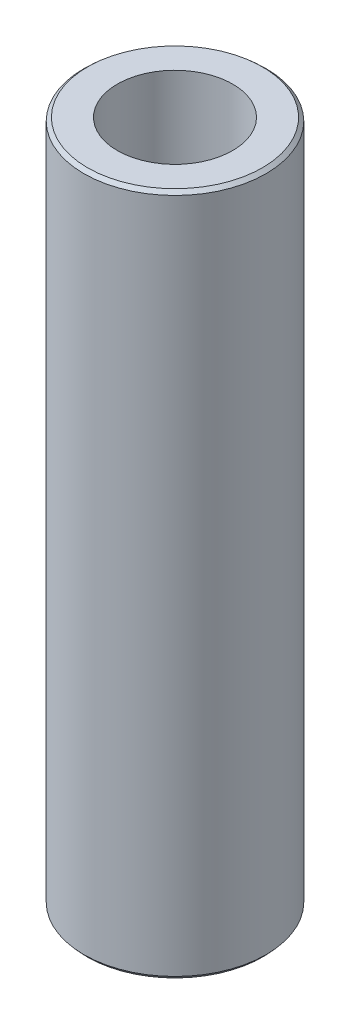
ISO-10303-21;
HEADER;
FILE_DESCRIPTION(('STEP AP214'),'2;1');
FILE_NAME('part.step','',(''),(''),'','','');
FILE_SCHEMA(('AUTOMOTIVE_DESIGN { 1 0 10303 214 1 1 1 1 }'));
ENDSEC;
DATA;
#1=APPLICATION_CONTEXT('core data for automotive mechanical design processes');
#2=APPLICATION_PROTOCOL_DEFINITION('international standard','automotive_design',2000,#1);
#3=PRODUCT_CONTEXT('',#1,'mechanical');
#4=PRODUCT('Part','Part','',(#3));
#5=PRODUCT_RELATED_PRODUCT_CATEGORY('part','',(#4));
#6=PRODUCT_DEFINITION_FORMATION('','',#4);
#7=PRODUCT_DEFINITION_CONTEXT('part definition',#1,'design');
#8=PRODUCT_DEFINITION('design','',#6,#7);
#9=PRODUCT_DEFINITION_SHAPE('','',#8);
#10=(LENGTH_UNIT() NAMED_UNIT(*) SI_UNIT(.MILLI.,.METRE.));
#11=(NAMED_UNIT(*) PLANE_ANGLE_UNIT() SI_UNIT($,.RADIAN.));
#12=(NAMED_UNIT(*) SI_UNIT($,.STERADIAN.) SOLID_ANGLE_UNIT());
#13=UNCERTAINTY_MEASURE_WITH_UNIT(LENGTH_MEASURE(1.E-05),#10,'distance_accuracy_value','');
#14=(GEOMETRIC_REPRESENTATION_CONTEXT(3) GLOBAL_UNCERTAINTY_ASSIGNED_CONTEXT((#13)) GLOBAL_UNIT_ASSIGNED_CONTEXT((#10,
#11,#12)) REPRESENTATION_CONTEXT('',''));
#15=CARTESIAN_POINT('',(0.,0.,0.));
#16=DIRECTION('',(0.,0.,1.));
#17=DIRECTION('',(1.,0.,0.));
#18=AXIS2_PLACEMENT_3D('',#15,#16,#17);
#19=CARTESIAN_POINT('',(0.,262.587591258309,0.));
#20=DIRECTION('',(0.,-1.,0.));
#21=DIRECTION('',(0.,0.,-1.));
#22=AXIS2_PLACEMENT_3D('',#19,#20,#21);
#23=CYLINDRICAL_SURFACE('',#22,35.);
#24=CARTESIAN_POINT('',(0.,261.322167376521,0.));
#25=DIRECTION('',(0.,1.,0.));
#26=DIRECTION('',(0.,0.,1.));
#27=AXIS2_PLACEMENT_3D('',#24,#25,#26);
#28=CIRCLE('',#27,35.);
#29=CARTESIAN_POINT('',(0.,261.322167376521,35.));
#30=VERTEX_POINT('',#29);
#31=EDGE_CURVE('E50',#30,#30,#28,.F.);
#32=ORIENTED_EDGE('',*,*,#31,.T.);
#33=EDGE_LOOP('',(#32));
#34=FACE_BOUND('',#33,.T.);
#35=CARTESIAN_POINT('',(0.,1.40365622843841,0.));
#36=DIRECTION('',(0.,1.,0.));
#37=DIRECTION('',(0.,0.,1.));
#38=AXIS2_PLACEMENT_3D('',#35,#36,#37);
#39=CIRCLE('',#38,35.);
#40=CARTESIAN_POINT('',(0.,1.40365622843841,35.));
#41=VERTEX_POINT('',#40);
#42=EDGE_CURVE('E51',#41,#41,#39,.T.);
#43=ORIENTED_EDGE('',*,*,#42,.T.);
#44=EDGE_LOOP('',(#43));
#45=FACE_BOUND('',#44,.T.);
#46=ADVANCED_FACE('F39',(#34,#45),#23,.T.);
#47=CARTESIAN_POINT('',(0.,262.587591258309,0.));
#48=DIRECTION('',(0.,1.,0.));
#49=DIRECTION('',(0.,0.,1.));
#50=AXIS2_PLACEMENT_3D('',#47,#48,#49);
#51=PLANE('',#50);
#52=CARTESIAN_POINT('',(0.,262.587591258309,0.));
#53=DIRECTION('',(0.,1.,0.));
#54=DIRECTION('',(0.,0.,1.));
#55=AXIS2_PLACEMENT_3D('',#52,#53,#54);
#56=CIRCLE('',#55,33.5963437715615);
#57=CARTESIAN_POINT('',(0.,262.587591258309,33.5963437715615));
#58=VERTEX_POINT('',#57);
#59=EDGE_CURVE('E54',#58,#58,#56,.T.);
#60=ORIENTED_EDGE('',*,*,#59,.T.);
#61=EDGE_LOOP('',(#60));
#62=FACE_BOUND('',#61,.T.);
#63=CARTESIAN_POINT('',(0.,262.587591258309,0.));
#64=DIRECTION('',(0.,1.,0.));
#65=DIRECTION('',(0.,0.,1.));
#66=AXIS2_PLACEMENT_3D('',#63,#64,#65);
#67=CIRCLE('',#66,22.1570664562936);
#68=CARTESIAN_POINT('',(0.,262.587591258309,22.1570664562936));
#69=VERTEX_POINT('',#68);
#70=EDGE_CURVE('E58',#69,#69,#67,.T.);
#71=ORIENTED_EDGE('',*,*,#70,.F.);
#72=EDGE_LOOP('',(#71));
#73=FACE_BOUND('',#72,.T.);
#74=ADVANCED_FACE('F69',(#62,#73),#51,.T.);
#75=CARTESIAN_POINT('',(0.,0.,0.));
#76=DIRECTION('',(0.,1.,0.));
#77=DIRECTION('',(0.,0.,1.));
#78=AXIS2_PLACEMENT_3D('',#75,#76,#77);
#79=PLANE('',#78);
#80=CARTESIAN_POINT('',(0.,0.,0.));
#81=DIRECTION('',(0.,1.,0.));
#82=DIRECTION('',(0.,0.,1.));
#83=AXIS2_PLACEMENT_3D('',#80,#81,#82);
#84=CIRCLE('',#83,33.734576118212);
#85=CARTESIAN_POINT('',(0.,0.,33.734576118212));
#86=VERTEX_POINT('',#85);
#87=EDGE_CURVE('E10',#86,#86,#84,.F.);
#88=ORIENTED_EDGE('',*,*,#87,.T.);
#89=EDGE_LOOP('',(#88));
#90=FACE_BOUND('',#89,.T.);
#91=CARTESIAN_POINT('',(0.,0.,0.));
#92=DIRECTION('',(0.,1.,0.));
#93=DIRECTION('',(0.,0.,1.));
#94=AXIS2_PLACEMENT_3D('',#91,#92,#93);
#95=CIRCLE('',#94,22.1570664562936);
#96=CARTESIAN_POINT('',(0.,0.,22.1570664562936));
#97=VERTEX_POINT('',#96);
#98=EDGE_CURVE('E63',#97,#97,#95,.T.);
#99=ORIENTED_EDGE('',*,*,#98,.T.);
#100=EDGE_LOOP('',(#99));
#101=FACE_BOUND('',#100,.T.);
#102=ADVANCED_FACE('F75',(#90,#101),#79,.F.);
#103=CARTESIAN_POINT('',(0.,262.587591258309,0.));
#104=DIRECTION('',(0.,-1.,0.));
#105=DIRECTION('',(0.,0.,-1.));
#106=AXIS2_PLACEMENT_3D('',#103,#104,#105);
#107=CYLINDRICAL_SURFACE('',#106,22.1570664562936);
#108=ORIENTED_EDGE('',*,*,#70,.T.);
#109=EDGE_LOOP('',(#108));
#110=FACE_BOUND('',#109,.T.);
#111=ORIENTED_EDGE('',*,*,#98,.F.);
#112=EDGE_LOOP('',(#111));
#113=FACE_BOUND('',#112,.T.);
#114=ADVANCED_FACE('F70',(#110,#113),#107,.F.);
#115=CARTESIAN_POINT('',(0.,262.587591258309,0.));
#116=DIRECTION('',(0.,-1.,0.));
#117=DIRECTION('',(0.,0.,-1.));
#118=AXIS2_PLACEMENT_3D('',#115,#116,#117);
#119=CONICAL_SURFACE('',#118,33.5963437715615,0.837142190969976);
#120=ORIENTED_EDGE('',*,*,#31,.F.);
#121=EDGE_LOOP('',(#120));
#122=FACE_BOUND('',#121,.T.);
#123=ORIENTED_EDGE('',*,*,#59,.F.);
#124=EDGE_LOOP('',(#123));
#125=FACE_BOUND('',#124,.T.);
#126=ADVANCED_FACE('F81',(#122,#125),#119,.T.);
#127=CARTESIAN_POINT('',(0.,1.40365622843841,0.));
#128=DIRECTION('',(0.,1.,0.));
#129=DIRECTION('',(0.,0.,1.));
#130=AXIS2_PLACEMENT_3D('',#127,#128,#129);
#131=CONICAL_SURFACE('',#130,35.,0.733654135824944);
#132=ORIENTED_EDGE('',*,*,#87,.F.);
#133=EDGE_LOOP('',(#132));
#134=FACE_BOUND('',#133,.T.);
#135=ORIENTED_EDGE('',*,*,#42,.F.);
#136=EDGE_LOOP('',(#135));
#137=FACE_BOUND('',#136,.T.);
#138=ADVANCED_FACE('F45',(#134,#137),#131,.T.);
#139=CLOSED_SHELL('',(#46,#74,#102,#114,#126,#138));
#140=MANIFOLD_SOLID_BREP('B2',#139);
#141=ADVANCED_BREP_SHAPE_REPRESENTATION('',(#18,#140),#14);
#142=SHAPE_DEFINITION_REPRESENTATION(#9,#141);
ENDSEC;
END-ISO-10303-21;
